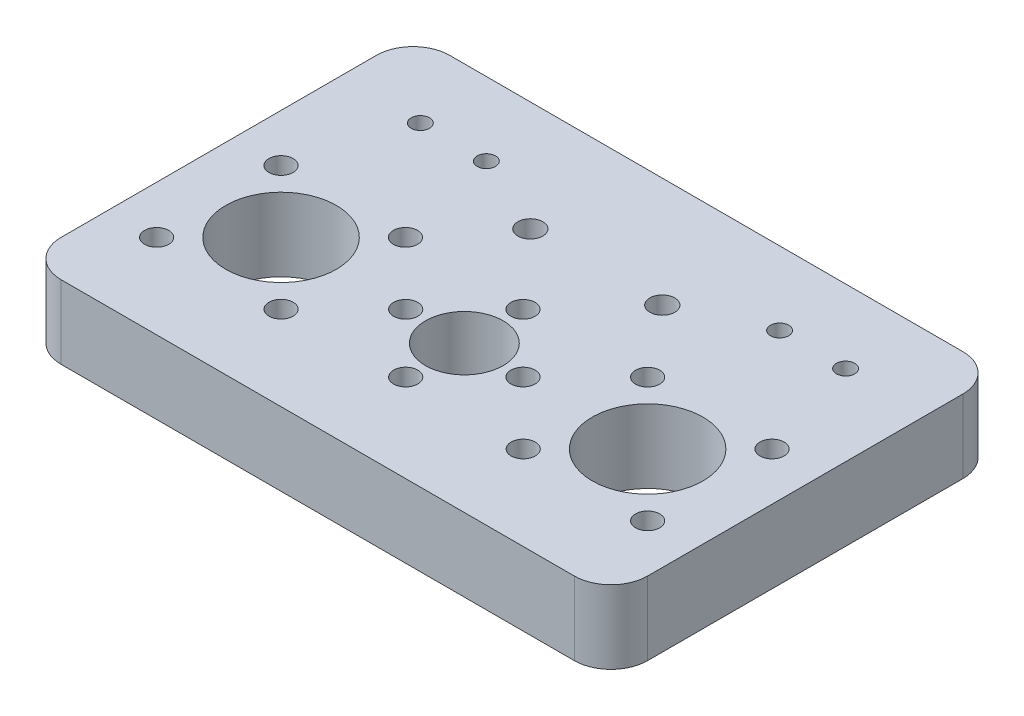
ISO-10303-21;
HEADER;
FILE_DESCRIPTION(('STEP AP214'),'2;1');
FILE_NAME('part.step','',(''),(''),'','','');
FILE_SCHEMA(('AUTOMOTIVE_DESIGN { 1 0 10303 214 1 1 1 1 }'));
ENDSEC;
DATA;
#1=APPLICATION_CONTEXT('core data for automotive mechanical design processes');
#2=APPLICATION_PROTOCOL_DEFINITION('international standard','automotive_design',2000,#1);
#3=PRODUCT_CONTEXT('',#1,'mechanical');
#4=PRODUCT('Part','Part','',(#3));
#5=PRODUCT_RELATED_PRODUCT_CATEGORY('part','',(#4));
#6=PRODUCT_DEFINITION_FORMATION('','',#4);
#7=PRODUCT_DEFINITION_CONTEXT('part definition',#1,'design');
#8=PRODUCT_DEFINITION('design','',#6,#7);
#9=PRODUCT_DEFINITION_SHAPE('','',#8);
#10=(LENGTH_UNIT() NAMED_UNIT(*) SI_UNIT(.MILLI.,.METRE.));
#11=(NAMED_UNIT(*) PLANE_ANGLE_UNIT() SI_UNIT($,.RADIAN.));
#12=(NAMED_UNIT(*) SI_UNIT($,.STERADIAN.) SOLID_ANGLE_UNIT());
#13=UNCERTAINTY_MEASURE_WITH_UNIT(LENGTH_MEASURE(1.E-05),#10,'distance_accuracy_value','');
#14=(GEOMETRIC_REPRESENTATION_CONTEXT(3) GLOBAL_UNCERTAINTY_ASSIGNED_CONTEXT((#13)) GLOBAL_UNIT_ASSIGNED_CONTEXT((#10,
#11,#12)) REPRESENTATION_CONTEXT('',''));
#15=CARTESIAN_POINT('',(0.,0.,0.));
#16=DIRECTION('',(0.,0.,1.));
#17=DIRECTION('',(1.,0.,0.));
#18=AXIS2_PLACEMENT_3D('',#15,#16,#17);
#19=CARTESIAN_POINT('',(0.,10.,-33.));
#20=DIRECTION('',(0.,0.,-1.));
#21=DIRECTION('',(-1.,0.,0.));
#22=AXIS2_PLACEMENT_3D('',#19,#20,#21);
#23=PLANE('',#22);
#24=DIRECTION('',(1.,0.,0.));
#25=VECTOR('',#24,1.);
#26=CARTESIAN_POINT('',(0.,0.,-33.));
#27=LINE('',#26,#25);
#28=CARTESIAN_POINT('',(-35.,0.,-33.));
#29=VERTEX_POINT('',#28);
#30=CARTESIAN_POINT('',(35.,0.,-33.));
#31=VERTEX_POINT('',#30);
#32=EDGE_CURVE('E189',#29,#31,#27,.T.);
#33=ORIENTED_EDGE('',*,*,#32,.F.);
#34=DIRECTION('',(0.,-1.,0.));
#35=VECTOR('',#34,1.);
#36=CARTESIAN_POINT('',(-35.,10.,-33.));
#37=LINE('',#36,#35);
#38=CARTESIAN_POINT('',(-35.,10.,-33.));
#39=VERTEX_POINT('',#38);
#40=EDGE_CURVE('E11',#39,#29,#37,.T.);
#41=ORIENTED_EDGE('',*,*,#40,.F.);
#42=DIRECTION('',(1.,0.,0.));
#43=VECTOR('',#42,1.);
#44=CARTESIAN_POINT('',(0.,10.,-33.));
#45=LINE('',#44,#43);
#46=CARTESIAN_POINT('',(35.,10.,-33.));
#47=VERTEX_POINT('',#46);
#48=EDGE_CURVE('E263',#39,#47,#45,.T.);
#49=ORIENTED_EDGE('',*,*,#48,.T.);
#50=DIRECTION('',(0.,-1.,0.));
#51=VECTOR('',#50,1.);
#52=CARTESIAN_POINT('',(35.,10.,-33.));
#53=LINE('',#52,#51);
#54=EDGE_CURVE('E87',#47,#31,#53,.T.);
#55=ORIENTED_EDGE('',*,*,#54,.T.);
#56=EDGE_LOOP('',(#33,#41,#49,#55));
#57=FACE_BOUND('',#56,.T.);
#58=ADVANCED_FACE('F37',(#57),#23,.T.);
#59=CARTESIAN_POINT('',(-35.,10.,-28.));
#60=DIRECTION('',(0.,-1.,0.));
#61=DIRECTION('',(0.,0.,-1.));
#62=AXIS2_PLACEMENT_3D('',#59,#60,#61);
#63=CYLINDRICAL_SURFACE('',#62,5.);
#64=CARTESIAN_POINT('',(-35.,0.,-28.));
#65=DIRECTION('',(0.,1.,0.));
#66=DIRECTION('',(0.,0.,1.));
#67=AXIS2_PLACEMENT_3D('',#64,#65,#66);
#68=CIRCLE('',#67,5.);
#69=CARTESIAN_POINT('',(-40.,0.,-28.));
#70=VERTEX_POINT('',#69);
#71=EDGE_CURVE('E192',#29,#70,#68,.T.);
#72=ORIENTED_EDGE('',*,*,#71,.T.);
#73=DIRECTION('',(0.,-1.,0.));
#74=VECTOR('',#73,1.);
#75=CARTESIAN_POINT('',(-40.,10.,-28.));
#76=LINE('',#75,#74);
#77=CARTESIAN_POINT('',(-40.,10.,-28.));
#78=VERTEX_POINT('',#77);
#79=EDGE_CURVE('E45',#78,#70,#76,.T.);
#80=ORIENTED_EDGE('',*,*,#79,.F.);
#81=CARTESIAN_POINT('',(-35.,10.,-28.));
#82=DIRECTION('',(0.,1.,0.));
#83=DIRECTION('',(0.,0.,1.));
#84=AXIS2_PLACEMENT_3D('',#81,#82,#83);
#85=CIRCLE('',#84,5.);
#86=EDGE_CURVE('E297',#39,#78,#85,.T.);
#87=ORIENTED_EDGE('',*,*,#86,.F.);
#88=ORIENTED_EDGE('',*,*,#40,.T.);
#89=EDGE_LOOP('',(#72,#80,#87,#88));
#90=FACE_BOUND('',#89,.T.);
#91=ADVANCED_FACE('F337',(#90),#63,.T.);
#92=CARTESIAN_POINT('',(-40.,10.,0.));
#93=DIRECTION('',(1.,0.,0.));
#94=DIRECTION('',(0.,0.,-1.));
#95=AXIS2_PLACEMENT_3D('',#92,#93,#94);
#96=PLANE('',#95);
#97=DIRECTION('',(0.,0.,1.));
#98=VECTOR('',#97,1.);
#99=CARTESIAN_POINT('',(-40.,0.,0.));
#100=LINE('',#99,#98);
#101=CARTESIAN_POINT('',(-40.,0.,15.));
#102=VERTEX_POINT('',#101);
#103=EDGE_CURVE('E195',#70,#102,#100,.T.);
#104=ORIENTED_EDGE('',*,*,#103,.T.);
#105=DIRECTION('',(0.,-1.,0.));
#106=VECTOR('',#105,1.);
#107=CARTESIAN_POINT('',(-40.,10.,15.));
#108=LINE('',#107,#106);
#109=CARTESIAN_POINT('',(-40.,10.,15.));
#110=VERTEX_POINT('',#109);
#111=EDGE_CURVE('E270',#110,#102,#108,.T.);
#112=ORIENTED_EDGE('',*,*,#111,.F.);
#113=DIRECTION('',(0.,0.,1.));
#114=VECTOR('',#113,1.);
#115=CARTESIAN_POINT('',(-40.,10.,0.));
#116=LINE('',#115,#114);
#117=EDGE_CURVE('E279',#78,#110,#116,.T.);
#118=ORIENTED_EDGE('',*,*,#117,.F.);
#119=ORIENTED_EDGE('',*,*,#79,.T.);
#120=EDGE_LOOP('',(#104,#112,#118,#119));
#121=FACE_BOUND('',#120,.T.);
#122=ADVANCED_FACE('F277',(#121),#96,.F.);
#123=CARTESIAN_POINT('',(-35.,10.,15.));
#124=DIRECTION('',(0.,-1.,0.));
#125=DIRECTION('',(0.,0.,-1.));
#126=AXIS2_PLACEMENT_3D('',#123,#124,#125);
#127=CYLINDRICAL_SURFACE('',#126,5.);
#128=CARTESIAN_POINT('',(-35.,0.,15.));
#129=DIRECTION('',(0.,1.,0.));
#130=DIRECTION('',(0.,0.,1.));
#131=AXIS2_PLACEMENT_3D('',#128,#129,#130);
#132=CIRCLE('',#131,5.);
#133=CARTESIAN_POINT('',(-35.,0.,20.));
#134=VERTEX_POINT('',#133);
#135=EDGE_CURVE('E197',#102,#134,#132,.T.);
#136=ORIENTED_EDGE('',*,*,#135,.T.);
#137=DIRECTION('',(0.,-1.,0.));
#138=VECTOR('',#137,1.);
#139=CARTESIAN_POINT('',(-35.,10.,20.));
#140=LINE('',#139,#138);
#141=CARTESIAN_POINT('',(-35.,10.,20.));
#142=VERTEX_POINT('',#141);
#143=EDGE_CURVE('E267',#142,#134,#140,.T.);
#144=ORIENTED_EDGE('',*,*,#143,.F.);
#145=CARTESIAN_POINT('',(-35.,10.,15.));
#146=DIRECTION('',(0.,1.,0.));
#147=DIRECTION('',(0.,0.,1.));
#148=AXIS2_PLACEMENT_3D('',#145,#146,#147);
#149=CIRCLE('',#148,5.);
#150=EDGE_CURVE('E293',#110,#142,#149,.T.);
#151=ORIENTED_EDGE('',*,*,#150,.F.);
#152=ORIENTED_EDGE('',*,*,#111,.T.);
#153=EDGE_LOOP('',(#136,#144,#151,#152));
#154=FACE_BOUND('',#153,.T.);
#155=ADVANCED_FACE('F289',(#154),#127,.T.);
#156=CARTESIAN_POINT('',(0.,10.,20.));
#157=DIRECTION('',(0.,0.,-1.));
#158=DIRECTION('',(-1.,0.,0.));
#159=AXIS2_PLACEMENT_3D('',#156,#157,#158);
#160=PLANE('',#159);
#161=DIRECTION('',(1.,0.,0.));
#162=VECTOR('',#161,1.);
#163=CARTESIAN_POINT('',(0.,0.,20.));
#164=LINE('',#163,#162);
#165=CARTESIAN_POINT('',(35.,0.,20.));
#166=VERTEX_POINT('',#165);
#167=EDGE_CURVE('E199',#134,#166,#164,.T.);
#168=ORIENTED_EDGE('',*,*,#167,.T.);
#169=DIRECTION('',(0.,-1.,0.));
#170=VECTOR('',#169,1.);
#171=CARTESIAN_POINT('',(35.,10.,20.));
#172=LINE('',#171,#170);
#173=CARTESIAN_POINT('',(35.,10.,20.));
#174=VERTEX_POINT('',#173);
#175=EDGE_CURVE('E125',#174,#166,#172,.T.);
#176=ORIENTED_EDGE('',*,*,#175,.F.);
#177=DIRECTION('',(1.,0.,0.));
#178=VECTOR('',#177,1.);
#179=CARTESIAN_POINT('',(0.,10.,20.));
#180=LINE('',#179,#178);
#181=EDGE_CURVE('E112',#142,#174,#180,.T.);
#182=ORIENTED_EDGE('',*,*,#181,.F.);
#183=ORIENTED_EDGE('',*,*,#143,.T.);
#184=EDGE_LOOP('',(#168,#176,#182,#183));
#185=FACE_BOUND('',#184,.T.);
#186=ADVANCED_FACE('F292',(#185),#160,.F.);
#187=CARTESIAN_POINT('',(35.,10.,15.));
#188=DIRECTION('',(0.,-1.,0.));
#189=DIRECTION('',(0.,0.,-1.));
#190=AXIS2_PLACEMENT_3D('',#187,#188,#189);
#191=CYLINDRICAL_SURFACE('',#190,5.);
#192=CARTESIAN_POINT('',(35.,0.,15.));
#193=DIRECTION('',(0.,1.,0.));
#194=DIRECTION('',(0.,0.,1.));
#195=AXIS2_PLACEMENT_3D('',#192,#193,#194);
#196=CIRCLE('',#195,5.);
#197=CARTESIAN_POINT('',(40.,0.,15.));
#198=VERTEX_POINT('',#197);
#199=EDGE_CURVE('E121',#166,#198,#196,.T.);
#200=ORIENTED_EDGE('',*,*,#199,.T.);
#201=DIRECTION('',(0.,-1.,0.));
#202=VECTOR('',#201,1.);
#203=CARTESIAN_POINT('',(40.,10.,15.));
#204=LINE('',#203,#202);
#205=CARTESIAN_POINT('',(40.,10.,15.));
#206=VERTEX_POINT('',#205);
#207=EDGE_CURVE('E118',#206,#198,#204,.T.);
#208=ORIENTED_EDGE('',*,*,#207,.F.);
#209=CARTESIAN_POINT('',(35.,10.,15.));
#210=DIRECTION('',(0.,1.,0.));
#211=DIRECTION('',(0.,0.,1.));
#212=AXIS2_PLACEMENT_3D('',#209,#210,#211);
#213=CIRCLE('',#212,5.);
#214=EDGE_CURVE('E105',#174,#206,#213,.T.);
#215=ORIENTED_EDGE('',*,*,#214,.F.);
#216=ORIENTED_EDGE('',*,*,#175,.T.);
#217=EDGE_LOOP('',(#200,#208,#215,#216));
#218=FACE_BOUND('',#217,.T.);
#219=ADVANCED_FACE('F119',(#218),#191,.T.);
#220=CARTESIAN_POINT('',(40.,10.,0.));
#221=DIRECTION('',(1.,0.,0.));
#222=DIRECTION('',(0.,0.,-1.));
#223=AXIS2_PLACEMENT_3D('',#220,#221,#222);
#224=PLANE('',#223);
#225=DIRECTION('',(0.,0.,1.));
#226=VECTOR('',#225,1.);
#227=CARTESIAN_POINT('',(40.,0.,0.));
#228=LINE('',#227,#226);
#229=CARTESIAN_POINT('',(40.,0.,-28.));
#230=VERTEX_POINT('',#229);
#231=EDGE_CURVE('E202',#230,#198,#228,.T.);
#232=ORIENTED_EDGE('',*,*,#231,.F.);
#233=DIRECTION('',(0.,-1.,0.));
#234=VECTOR('',#233,1.);
#235=CARTESIAN_POINT('',(40.,10.,-28.));
#236=LINE('',#235,#234);
#237=CARTESIAN_POINT('',(40.,10.,-28.));
#238=VERTEX_POINT('',#237);
#239=EDGE_CURVE('E80',#238,#230,#236,.T.);
#240=ORIENTED_EDGE('',*,*,#239,.F.);
#241=DIRECTION('',(0.,0.,1.));
#242=VECTOR('',#241,1.);
#243=CARTESIAN_POINT('',(40.,10.,0.));
#244=LINE('',#243,#242);
#245=EDGE_CURVE('E110',#238,#206,#244,.T.);
#246=ORIENTED_EDGE('',*,*,#245,.T.);
#247=ORIENTED_EDGE('',*,*,#207,.T.);
#248=EDGE_LOOP('',(#232,#240,#246,#247));
#249=FACE_BOUND('',#248,.T.);
#250=ADVANCED_FACE('F127',(#249),#224,.T.);
#251=CARTESIAN_POINT('',(-29.,10.,-23.));
#252=DIRECTION('',(0.,-1.,0.));
#253=DIRECTION('',(0.,0.,-1.));
#254=AXIS2_PLACEMENT_3D('',#251,#252,#253);
#255=CYLINDRICAL_SURFACE('',#254,1.25);
#256=CARTESIAN_POINT('',(-29.,10.,-23.));
#257=DIRECTION('',(0.,1.,0.));
#258=DIRECTION('',(0.,0.,1.));
#259=AXIS2_PLACEMENT_3D('',#256,#257,#258);
#260=CIRCLE('',#259,1.25);
#261=CARTESIAN_POINT('',(-29.,10.,-21.75));
#262=VERTEX_POINT('',#261);
#263=EDGE_CURVE('E183',#262,#262,#260,.T.);
#264=ORIENTED_EDGE('',*,*,#263,.T.);
#265=EDGE_LOOP('',(#264));
#266=FACE_BOUND('',#265,.T.);
#267=CARTESIAN_POINT('',(-29.,0.,-23.));
#268=DIRECTION('',(0.,1.,0.));
#269=DIRECTION('',(0.,0.,1.));
#270=AXIS2_PLACEMENT_3D('',#267,#268,#269);
#271=CIRCLE('',#270,1.25);
#272=CARTESIAN_POINT('',(-29.,0.,-21.75));
#273=VERTEX_POINT('',#272);
#274=EDGE_CURVE('E257',#273,#273,#271,.T.);
#275=ORIENTED_EDGE('',*,*,#274,.F.);
#276=EDGE_LOOP('',(#275));
#277=FACE_BOUND('',#276,.T.);
#278=ADVANCED_FACE('F358',(#266,#277),#255,.F.);
#279=CARTESIAN_POINT('',(33.4852813742386,10.,-8.48528137423854));
#280=DIRECTION('',(0.,-1.,0.));
#281=DIRECTION('',(0.,0.,-1.));
#282=AXIS2_PLACEMENT_3D('',#279,#280,#281);
#283=CYLINDRICAL_SURFACE('',#282,1.65);
#284=CARTESIAN_POINT('',(33.4852813742386,10.,-8.48528137423854));
#285=DIRECTION('',(0.,1.,0.));
#286=DIRECTION('',(0.,0.,1.));
#287=AXIS2_PLACEMENT_3D('',#284,#285,#286);
#288=CIRCLE('',#287,1.65);
#289=CARTESIAN_POINT('',(33.4852813742386,10.,-6.83528137423855));
#290=VERTEX_POINT('',#289);
#291=EDGE_CURVE('E180',#290,#290,#288,.F.);
#292=ORIENTED_EDGE('',*,*,#291,.F.);
#293=EDGE_LOOP('',(#292));
#294=FACE_BOUND('',#293,.T.);
#295=CARTESIAN_POINT('',(33.4852813742386,0.,-8.48528137423854));
#296=DIRECTION('',(0.,1.,0.));
#297=DIRECTION('',(0.,0.,1.));
#298=AXIS2_PLACEMENT_3D('',#295,#296,#297);
#299=CIRCLE('',#298,1.65);
#300=CARTESIAN_POINT('',(33.4852813742386,0.,-6.83528137423855));
#301=VERTEX_POINT('',#300);
#302=EDGE_CURVE('E254',#301,#301,#299,.F.);
#303=ORIENTED_EDGE('',*,*,#302,.T.);
#304=EDGE_LOOP('',(#303));
#305=FACE_BOUND('',#304,.T.);
#306=ADVANCED_FACE('F392',(#294,#305),#283,.F.);
#307=CARTESIAN_POINT('',(16.5147186257614,10.,8.48528137423852));
#308=DIRECTION('',(0.,-1.,0.));
#309=DIRECTION('',(0.,0.,-1.));
#310=AXIS2_PLACEMENT_3D('',#307,#308,#309);
#311=CYLINDRICAL_SURFACE('',#310,1.64999999999999);
#312=CARTESIAN_POINT('',(16.5147186257614,10.,8.48528137423852));
#313=DIRECTION('',(0.,1.,0.));
#314=DIRECTION('',(0.,0.,1.));
#315=AXIS2_PLACEMENT_3D('',#312,#313,#314);
#316=CIRCLE('',#315,1.64999999999999);
#317=CARTESIAN_POINT('',(16.5147186257614,10.,10.1352813742385));
#318=VERTEX_POINT('',#317);
#319=EDGE_CURVE('E177',#318,#318,#316,.F.);
#320=ORIENTED_EDGE('',*,*,#319,.F.);
#321=EDGE_LOOP('',(#320));
#322=FACE_BOUND('',#321,.T.);
#323=CARTESIAN_POINT('',(16.5147186257614,0.,8.48528137423852));
#324=DIRECTION('',(0.,1.,0.));
#325=DIRECTION('',(0.,0.,1.));
#326=AXIS2_PLACEMENT_3D('',#323,#324,#325);
#327=CIRCLE('',#326,1.64999999999999);
#328=CARTESIAN_POINT('',(16.5147186257614,0.,10.1352813742385));
#329=VERTEX_POINT('',#328);
#330=EDGE_CURVE('E251',#329,#329,#327,.F.);
#331=ORIENTED_EDGE('',*,*,#330,.T.);
#332=EDGE_LOOP('',(#331));
#333=FACE_BOUND('',#332,.T.);
#334=ADVANCED_FACE('F400',(#322,#333),#311,.F.);
#335=CARTESIAN_POINT('',(25.,10.,0.));
#336=DIRECTION('',(0.,-1.,0.));
#337=DIRECTION('',(0.,0.,-1.));
#338=AXIS2_PLACEMENT_3D('',#335,#336,#337);
#339=CYLINDRICAL_SURFACE('',#338,7.55);
#340=CARTESIAN_POINT('',(25.,10.,0.));
#341=DIRECTION('',(0.,1.,0.));
#342=DIRECTION('',(0.,0.,1.));
#343=AXIS2_PLACEMENT_3D('',#340,#341,#342);
#344=CIRCLE('',#343,7.55);
#345=CARTESIAN_POINT('',(25.,10.,7.55));
#346=VERTEX_POINT('',#345);
#347=EDGE_CURVE('E174',#346,#346,#344,.F.);
#348=ORIENTED_EDGE('',*,*,#347,.F.);
#349=EDGE_LOOP('',(#348));
#350=FACE_BOUND('',#349,.T.);
#351=CARTESIAN_POINT('',(25.,0.,0.));
#352=DIRECTION('',(0.,1.,0.));
#353=DIRECTION('',(0.,0.,1.));
#354=AXIS2_PLACEMENT_3D('',#351,#352,#353);
#355=CIRCLE('',#354,7.55);
#356=CARTESIAN_POINT('',(25.,0.,7.55));
#357=VERTEX_POINT('',#356);
#358=EDGE_CURVE('E248',#357,#357,#355,.F.);
#359=ORIENTED_EDGE('',*,*,#358,.T.);
#360=EDGE_LOOP('',(#359));
#361=FACE_BOUND('',#360,.T.);
#362=ADVANCED_FACE('F408',(#350,#361),#339,.F.);
#363=CARTESIAN_POINT('',(-33.4852813742385,10.,8.48528137423861));
#364=DIRECTION('',(0.,-1.,0.));
#365=DIRECTION('',(0.,0.,-1.));
#366=AXIS2_PLACEMENT_3D('',#363,#364,#365);
#367=CYLINDRICAL_SURFACE('',#366,1.65);
#368=CARTESIAN_POINT('',(-33.4852813742385,10.,8.48528137423861));
#369=DIRECTION('',(0.,1.,0.));
#370=DIRECTION('',(0.,0.,1.));
#371=AXIS2_PLACEMENT_3D('',#368,#369,#370);
#372=CIRCLE('',#371,1.65);
#373=CARTESIAN_POINT('',(-33.4852813742385,10.,10.1352813742386));
#374=VERTEX_POINT('',#373);
#375=EDGE_CURVE('E171',#374,#374,#372,.T.);
#376=ORIENTED_EDGE('',*,*,#375,.T.);
#377=EDGE_LOOP('',(#376));
#378=FACE_BOUND('',#377,.T.);
#379=CARTESIAN_POINT('',(-33.4852813742385,0.,8.48528137423861));
#380=DIRECTION('',(0.,1.,0.));
#381=DIRECTION('',(0.,0.,1.));
#382=AXIS2_PLACEMENT_3D('',#379,#380,#381);
#383=CIRCLE('',#382,1.65);
#384=CARTESIAN_POINT('',(-33.4852813742385,0.,10.1352813742386));
#385=VERTEX_POINT('',#384);
#386=EDGE_CURVE('E245',#385,#385,#383,.T.);
#387=ORIENTED_EDGE('',*,*,#386,.F.);
#388=EDGE_LOOP('',(#387));
#389=FACE_BOUND('',#388,.T.);
#390=ADVANCED_FACE('F416',(#378,#389),#367,.F.);
#391=CARTESIAN_POINT('',(-16.5147186257614,10.,8.48528137423852));
#392=DIRECTION('',(0.,-1.,0.));
#393=DIRECTION('',(0.,0.,-1.));
#394=AXIS2_PLACEMENT_3D('',#391,#392,#393);
#395=CYLINDRICAL_SURFACE('',#394,1.64999999999999);
#396=CARTESIAN_POINT('',(-16.5147186257614,10.,8.48528137423852));
#397=DIRECTION('',(0.,1.,0.));
#398=DIRECTION('',(0.,0.,1.));
#399=AXIS2_PLACEMENT_3D('',#396,#397,#398);
#400=CIRCLE('',#399,1.64999999999999);
#401=CARTESIAN_POINT('',(-16.5147186257614,10.,10.1352813742385));
#402=VERTEX_POINT('',#401);
#403=EDGE_CURVE('E168',#402,#402,#400,.T.);
#404=ORIENTED_EDGE('',*,*,#403,.T.);
#405=EDGE_LOOP('',(#404));
#406=FACE_BOUND('',#405,.T.);
#407=CARTESIAN_POINT('',(-16.5147186257614,0.,8.48528137423852));
#408=DIRECTION('',(0.,1.,0.));
#409=DIRECTION('',(0.,0.,1.));
#410=AXIS2_PLACEMENT_3D('',#407,#408,#409);
#411=CIRCLE('',#410,1.64999999999999);
#412=CARTESIAN_POINT('',(-16.5147186257614,0.,10.1352813742385));
#413=VERTEX_POINT('',#412);
#414=EDGE_CURVE('E242',#413,#413,#411,.T.);
#415=ORIENTED_EDGE('',*,*,#414,.F.);
#416=EDGE_LOOP('',(#415));
#417=FACE_BOUND('',#416,.T.);
#418=ADVANCED_FACE('F424',(#406,#417),#395,.F.);
#419=CARTESIAN_POINT('',(-16.5147186257615,10.,-8.48528137423862));
#420=DIRECTION('',(0.,-1.,0.));
#421=DIRECTION('',(0.,0.,-1.));
#422=AXIS2_PLACEMENT_3D('',#419,#420,#421);
#423=CYLINDRICAL_SURFACE('',#422,1.65);
#424=CARTESIAN_POINT('',(-16.5147186257615,10.,-8.48528137423862));
#425=DIRECTION('',(0.,1.,0.));
#426=DIRECTION('',(0.,0.,1.));
#427=AXIS2_PLACEMENT_3D('',#424,#425,#426);
#428=CIRCLE('',#427,1.65);
#429=CARTESIAN_POINT('',(-16.5147186257615,10.,-6.83528137423862));
#430=VERTEX_POINT('',#429);
#431=EDGE_CURVE('E165',#430,#430,#428,.T.);
#432=ORIENTED_EDGE('',*,*,#431,.T.);
#433=EDGE_LOOP('',(#432));
#434=FACE_BOUND('',#433,.T.);
#435=CARTESIAN_POINT('',(-16.5147186257615,0.,-8.48528137423862));
#436=DIRECTION('',(0.,1.,0.));
#437=DIRECTION('',(0.,0.,1.));
#438=AXIS2_PLACEMENT_3D('',#435,#436,#437);
#439=CIRCLE('',#438,1.65);
#440=CARTESIAN_POINT('',(-16.5147186257615,0.,-6.83528137423862));
#441=VERTEX_POINT('',#440);
#442=EDGE_CURVE('E239',#441,#441,#439,.T.);
#443=ORIENTED_EDGE('',*,*,#442,.F.);
#444=EDGE_LOOP('',(#443));
#445=FACE_BOUND('',#444,.T.);
#446=ADVANCED_FACE('F432',(#434,#445),#423,.F.);
#447=CARTESIAN_POINT('',(-33.4852813742386,10.,-8.48528137423853));
#448=DIRECTION('',(0.,-1.,0.));
#449=DIRECTION('',(0.,0.,-1.));
#450=AXIS2_PLACEMENT_3D('',#447,#448,#449);
#451=CYLINDRICAL_SURFACE('',#450,1.65);
#452=CARTESIAN_POINT('',(-33.4852813742386,10.,-8.48528137423853));
#453=DIRECTION('',(0.,1.,0.));
#454=DIRECTION('',(0.,0.,1.));
#455=AXIS2_PLACEMENT_3D('',#452,#453,#454);
#456=CIRCLE('',#455,1.65);
#457=CARTESIAN_POINT('',(-33.4852813742386,10.,-6.83528137423853));
#458=VERTEX_POINT('',#457);
#459=EDGE_CURVE('E162',#458,#458,#456,.T.);
#460=ORIENTED_EDGE('',*,*,#459,.T.);
#461=EDGE_LOOP('',(#460));
#462=FACE_BOUND('',#461,.T.);
#463=CARTESIAN_POINT('',(-33.4852813742386,0.,-8.48528137423853));
#464=DIRECTION('',(0.,1.,0.));
#465=DIRECTION('',(0.,0.,1.));
#466=AXIS2_PLACEMENT_3D('',#463,#464,#465);
#467=CIRCLE('',#466,1.65);
#468=CARTESIAN_POINT('',(-33.4852813742386,0.,-6.83528137423853));
#469=VERTEX_POINT('',#468);
#470=EDGE_CURVE('E236',#469,#469,#467,.T.);
#471=ORIENTED_EDGE('',*,*,#470,.F.);
#472=EDGE_LOOP('',(#471));
#473=FACE_BOUND('',#472,.T.);
#474=ADVANCED_FACE('F440',(#462,#473),#451,.F.);
#475=CARTESIAN_POINT('',(-25.,10.,0.));
#476=DIRECTION('',(0.,-1.,0.));
#477=DIRECTION('',(0.,0.,-1.));
#478=AXIS2_PLACEMENT_3D('',#475,#476,#477);
#479=CYLINDRICAL_SURFACE('',#478,7.55);
#480=CARTESIAN_POINT('',(-25.,10.,0.));
#481=DIRECTION('',(0.,1.,0.));
#482=DIRECTION('',(0.,0.,1.));
#483=AXIS2_PLACEMENT_3D('',#480,#481,#482);
#484=CIRCLE('',#483,7.55);
#485=CARTESIAN_POINT('',(-25.,10.,7.55));
#486=VERTEX_POINT('',#485);
#487=EDGE_CURVE('E159',#486,#486,#484,.T.);
#488=ORIENTED_EDGE('',*,*,#487,.T.);
#489=EDGE_LOOP('',(#488));
#490=FACE_BOUND('',#489,.T.);
#491=CARTESIAN_POINT('',(-25.,0.,0.));
#492=DIRECTION('',(0.,1.,0.));
#493=DIRECTION('',(0.,0.,1.));
#494=AXIS2_PLACEMENT_3D('',#491,#492,#493);
#495=CIRCLE('',#494,7.55);
#496=CARTESIAN_POINT('',(-25.,0.,7.55));
#497=VERTEX_POINT('',#496);
#498=EDGE_CURVE('E233',#497,#497,#495,.T.);
#499=ORIENTED_EDGE('',*,*,#498,.F.);
#500=EDGE_LOOP('',(#499));
#501=FACE_BOUND('',#500,.T.);
#502=ADVANCED_FACE('F448',(#490,#501),#479,.F.);
#503=CARTESIAN_POINT('',(-8.,10.,0.));
#504=DIRECTION('',(0.,-1.,0.));
#505=DIRECTION('',(0.,0.,-1.));
#506=AXIS2_PLACEMENT_3D('',#503,#504,#505);
#507=CYLINDRICAL_SURFACE('',#506,1.64999999999997);
#508=CARTESIAN_POINT('',(-8.,10.,0.));
#509=DIRECTION('',(0.,1.,0.));
#510=DIRECTION('',(0.,0.,1.));
#511=AXIS2_PLACEMENT_3D('',#508,#509,#510);
#512=CIRCLE('',#511,1.64999999999997);
#513=CARTESIAN_POINT('',(-8.,10.,1.64999999999996));
#514=VERTEX_POINT('',#513);
#515=EDGE_CURVE('E156',#514,#514,#512,.T.);
#516=ORIENTED_EDGE('',*,*,#515,.T.);
#517=EDGE_LOOP('',(#516));
#518=FACE_BOUND('',#517,.T.);
#519=CARTESIAN_POINT('',(-8.,0.,0.));
#520=DIRECTION('',(0.,1.,0.));
#521=DIRECTION('',(0.,0.,1.));
#522=AXIS2_PLACEMENT_3D('',#519,#520,#521);
#523=CIRCLE('',#522,1.64999999999997);
#524=CARTESIAN_POINT('',(-8.,0.,1.64999999999996));
#525=VERTEX_POINT('',#524);
#526=EDGE_CURVE('E230',#525,#525,#523,.T.);
#527=ORIENTED_EDGE('',*,*,#526,.F.);
#528=EDGE_LOOP('',(#527));
#529=FACE_BOUND('',#528,.T.);
#530=ADVANCED_FACE('F456',(#518,#529),#507,.F.);
#531=CARTESIAN_POINT('',(0.,10.,8.));
#532=DIRECTION('',(0.,-1.,0.));
#533=DIRECTION('',(0.,0.,-1.));
#534=AXIS2_PLACEMENT_3D('',#531,#532,#533);
#535=CYLINDRICAL_SURFACE('',#534,1.65);
#536=CARTESIAN_POINT('',(0.,10.,8.));
#537=DIRECTION('',(0.,1.,0.));
#538=DIRECTION('',(0.,0.,1.));
#539=AXIS2_PLACEMENT_3D('',#536,#537,#538);
#540=CIRCLE('',#539,1.65);
#541=CARTESIAN_POINT('',(0.,10.,9.65));
#542=VERTEX_POINT('',#541);
#543=EDGE_CURVE('E153',#542,#542,#540,.T.);
#544=ORIENTED_EDGE('',*,*,#543,.T.);
#545=EDGE_LOOP('',(#544));
#546=FACE_BOUND('',#545,.T.);
#547=CARTESIAN_POINT('',(0.,0.,8.));
#548=DIRECTION('',(0.,1.,0.));
#549=DIRECTION('',(0.,0.,1.));
#550=AXIS2_PLACEMENT_3D('',#547,#548,#549);
#551=CIRCLE('',#550,1.65);
#552=CARTESIAN_POINT('',(0.,0.,9.65));
#553=VERTEX_POINT('',#552);
#554=EDGE_CURVE('E227',#553,#553,#551,.T.);
#555=ORIENTED_EDGE('',*,*,#554,.F.);
#556=EDGE_LOOP('',(#555));
#557=FACE_BOUND('',#556,.T.);
#558=ADVANCED_FACE('F464',(#546,#557),#535,.F.);
#559=CARTESIAN_POINT('',(8.,10.,0.));
#560=DIRECTION('',(0.,-1.,0.));
#561=DIRECTION('',(0.,0.,-1.));
#562=AXIS2_PLACEMENT_3D('',#559,#560,#561);
#563=CYLINDRICAL_SURFACE('',#562,1.65);
#564=CARTESIAN_POINT('',(8.,10.,0.));
#565=DIRECTION('',(0.,1.,0.));
#566=DIRECTION('',(0.,0.,1.));
#567=AXIS2_PLACEMENT_3D('',#564,#565,#566);
#568=CIRCLE('',#567,1.65);
#569=CARTESIAN_POINT('',(8.,10.,1.65000000000003));
#570=VERTEX_POINT('',#569);
#571=EDGE_CURVE('E150',#570,#570,#568,.T.);
#572=ORIENTED_EDGE('',*,*,#571,.T.);
#573=EDGE_LOOP('',(#572));
#574=FACE_BOUND('',#573,.T.);
#575=CARTESIAN_POINT('',(8.,0.,0.));
#576=DIRECTION('',(0.,1.,0.));
#577=DIRECTION('',(0.,0.,1.));
#578=AXIS2_PLACEMENT_3D('',#575,#576,#577);
#579=CIRCLE('',#578,1.65);
#580=CARTESIAN_POINT('',(8.,0.,1.65000000000003));
#581=VERTEX_POINT('',#580);
#582=EDGE_CURVE('E224',#581,#581,#579,.T.);
#583=ORIENTED_EDGE('',*,*,#582,.F.);
#584=EDGE_LOOP('',(#583));
#585=FACE_BOUND('',#584,.T.);
#586=ADVANCED_FACE('F472',(#574,#585),#563,.F.);
#587=CARTESIAN_POINT('',(0.,10.,-8.));
#588=DIRECTION('',(0.,-1.,0.));
#589=DIRECTION('',(0.,0.,-1.));
#590=AXIS2_PLACEMENT_3D('',#587,#588,#589);
#591=CYLINDRICAL_SURFACE('',#590,1.65);
#592=CARTESIAN_POINT('',(0.,10.,-8.));
#593=DIRECTION('',(0.,1.,0.));
#594=DIRECTION('',(0.,0.,1.));
#595=AXIS2_PLACEMENT_3D('',#592,#593,#594);
#596=CIRCLE('',#595,1.65);
#597=CARTESIAN_POINT('',(0.,10.,-6.35));
#598=VERTEX_POINT('',#597);
#599=EDGE_CURVE('E147',#598,#598,#596,.T.);
#600=ORIENTED_EDGE('',*,*,#599,.T.);
#601=EDGE_LOOP('',(#600));
#602=FACE_BOUND('',#601,.T.);
#603=CARTESIAN_POINT('',(0.,0.,-8.));
#604=DIRECTION('',(0.,1.,0.));
#605=DIRECTION('',(0.,0.,1.));
#606=AXIS2_PLACEMENT_3D('',#603,#604,#605);
#607=CIRCLE('',#606,1.65);
#608=CARTESIAN_POINT('',(0.,0.,-6.35));
#609=VERTEX_POINT('',#608);
#610=EDGE_CURVE('E221',#609,#609,#607,.T.);
#611=ORIENTED_EDGE('',*,*,#610,.F.);
#612=EDGE_LOOP('',(#611));
#613=FACE_BOUND('',#612,.T.);
#614=ADVANCED_FACE('F480',(#602,#613),#591,.F.);
#615=CARTESIAN_POINT('',(0.,10.,0.));
#616=DIRECTION('',(0.,-1.,0.));
#617=DIRECTION('',(0.,0.,-1.));
#618=AXIS2_PLACEMENT_3D('',#615,#616,#617);
#619=CYLINDRICAL_SURFACE('',#618,5.3);
#620=CARTESIAN_POINT('',(0.,10.,0.));
#621=DIRECTION('',(0.,1.,0.));
#622=DIRECTION('',(0.,0.,1.));
#623=AXIS2_PLACEMENT_3D('',#620,#621,#622);
#624=CIRCLE('',#623,5.3);
#625=CARTESIAN_POINT('',(0.,10.,5.3));
#626=VERTEX_POINT('',#625);
#627=EDGE_CURVE('E144',#626,#626,#624,.T.);
#628=ORIENTED_EDGE('',*,*,#627,.T.);
#629=EDGE_LOOP('',(#628));
#630=FACE_BOUND('',#629,.T.);
#631=CARTESIAN_POINT('',(0.,0.,0.));
#632=DIRECTION('',(0.,1.,0.));
#633=DIRECTION('',(0.,0.,1.));
#634=AXIS2_PLACEMENT_3D('',#631,#632,#633);
#635=CIRCLE('',#634,5.3);
#636=CARTESIAN_POINT('',(0.,0.,5.3));
#637=VERTEX_POINT('',#636);
#638=EDGE_CURVE('E218',#637,#637,#635,.T.);
#639=ORIENTED_EDGE('',*,*,#638,.F.);
#640=EDGE_LOOP('',(#639));
#641=FACE_BOUND('',#640,.T.);
#642=ADVANCED_FACE('F488',(#630,#641),#619,.F.);
#643=CARTESIAN_POINT('',(16.5147186257615,10.,-8.48528137423862));
#644=DIRECTION('',(0.,-1.,0.));
#645=DIRECTION('',(0.,0.,-1.));
#646=AXIS2_PLACEMENT_3D('',#643,#644,#645);
#647=CYLINDRICAL_SURFACE('',#646,1.65);
#648=CARTESIAN_POINT('',(16.5147186257615,10.,-8.48528137423862));
#649=DIRECTION('',(0.,1.,0.));
#650=DIRECTION('',(0.,0.,1.));
#651=AXIS2_PLACEMENT_3D('',#648,#649,#650);
#652=CIRCLE('',#651,1.65);
#653=CARTESIAN_POINT('',(16.5147186257615,10.,-6.83528137423862));
#654=VERTEX_POINT('',#653);
#655=EDGE_CURVE('E141',#654,#654,#652,.F.);
#656=ORIENTED_EDGE('',*,*,#655,.F.);
#657=EDGE_LOOP('',(#656));
#658=FACE_BOUND('',#657,.T.);
#659=CARTESIAN_POINT('',(16.5147186257615,0.,-8.48528137423862));
#660=DIRECTION('',(0.,1.,0.));
#661=DIRECTION('',(0.,0.,1.));
#662=AXIS2_PLACEMENT_3D('',#659,#660,#661);
#663=CIRCLE('',#662,1.65);
#664=CARTESIAN_POINT('',(16.5147186257615,0.,-6.83528137423862));
#665=VERTEX_POINT('',#664);
#666=EDGE_CURVE('E215',#665,#665,#663,.F.);
#667=ORIENTED_EDGE('',*,*,#666,.T.);
#668=EDGE_LOOP('',(#667));
#669=FACE_BOUND('',#668,.T.);
#670=ADVANCED_FACE('F496',(#658,#669),#647,.F.);
#671=CARTESIAN_POINT('',(33.4852813742385,10.,8.48528137423861));
#672=DIRECTION('',(0.,-1.,0.));
#673=DIRECTION('',(0.,0.,-1.));
#674=AXIS2_PLACEMENT_3D('',#671,#672,#673);
#675=CYLINDRICAL_SURFACE('',#674,1.65);
#676=CARTESIAN_POINT('',(33.4852813742385,10.,8.48528137423861));
#677=DIRECTION('',(0.,1.,0.));
#678=DIRECTION('',(0.,0.,1.));
#679=AXIS2_PLACEMENT_3D('',#676,#677,#678);
#680=CIRCLE('',#679,1.65);
#681=CARTESIAN_POINT('',(33.4852813742385,10.,10.1352813742386));
#682=VERTEX_POINT('',#681);
#683=EDGE_CURVE('E138',#682,#682,#680,.F.);
#684=ORIENTED_EDGE('',*,*,#683,.F.);
#685=EDGE_LOOP('',(#684));
#686=FACE_BOUND('',#685,.T.);
#687=CARTESIAN_POINT('',(33.4852813742385,0.,8.48528137423861));
#688=DIRECTION('',(0.,1.,0.));
#689=DIRECTION('',(0.,0.,1.));
#690=AXIS2_PLACEMENT_3D('',#687,#688,#689);
#691=CIRCLE('',#690,1.65);
#692=CARTESIAN_POINT('',(33.4852813742385,0.,10.1352813742386));
#693=VERTEX_POINT('',#692);
#694=EDGE_CURVE('E212',#693,#693,#691,.F.);
#695=ORIENTED_EDGE('',*,*,#694,.T.);
#696=EDGE_LOOP('',(#695));
#697=FACE_BOUND('',#696,.T.);
#698=ADVANCED_FACE('F504',(#686,#697),#675,.F.);
#699=CARTESIAN_POINT('',(-20.,10.,-23.));
#700=DIRECTION('',(0.,-1.,0.));
#701=DIRECTION('',(0.,0.,-1.));
#702=AXIS2_PLACEMENT_3D('',#699,#700,#701);
#703=CYLINDRICAL_SURFACE('',#702,1.25);
#704=CARTESIAN_POINT('',(-20.,10.,-23.));
#705=DIRECTION('',(0.,1.,0.));
#706=DIRECTION('',(0.,0.,1.));
#707=AXIS2_PLACEMENT_3D('',#704,#705,#706);
#708=CIRCLE('',#707,1.25);
#709=CARTESIAN_POINT('',(-20.,10.,-21.75));
#710=VERTEX_POINT('',#709);
#711=EDGE_CURVE('E135',#710,#710,#708,.T.);
#712=ORIENTED_EDGE('',*,*,#711,.T.);
#713=EDGE_LOOP('',(#712));
#714=FACE_BOUND('',#713,.T.);
#715=CARTESIAN_POINT('',(-20.,0.,-23.));
#716=DIRECTION('',(0.,1.,0.));
#717=DIRECTION('',(0.,0.,1.));
#718=AXIS2_PLACEMENT_3D('',#715,#716,#717);
#719=CIRCLE('',#718,1.25);
#720=CARTESIAN_POINT('',(-20.,0.,-21.75));
#721=VERTEX_POINT('',#720);
#722=EDGE_CURVE('E209',#721,#721,#719,.T.);
#723=ORIENTED_EDGE('',*,*,#722,.F.);
#724=EDGE_LOOP('',(#723));
#725=FACE_BOUND('',#724,.T.);
#726=ADVANCED_FACE('F351',(#714,#725),#703,.F.);
#727=CARTESIAN_POINT('',(20.,10.,-23.));
#728=DIRECTION('',(0.,-1.,0.));
#729=DIRECTION('',(0.,0.,-1.));
#730=AXIS2_PLACEMENT_3D('',#727,#728,#729);
#731=CYLINDRICAL_SURFACE('',#730,1.25);
#732=CARTESIAN_POINT('',(20.,10.,-23.));
#733=DIRECTION('',(0.,1.,0.));
#734=DIRECTION('',(0.,0.,1.));
#735=AXIS2_PLACEMENT_3D('',#732,#733,#734);
#736=CIRCLE('',#735,1.25);
#737=CARTESIAN_POINT('',(20.,10.,-21.75));
#738=VERTEX_POINT('',#737);
#739=EDGE_CURVE('E129',#738,#738,#736,.T.);
#740=ORIENTED_EDGE('',*,*,#739,.T.);
#741=EDGE_LOOP('',(#740));
#742=FACE_BOUND('',#741,.T.);
#743=CARTESIAN_POINT('',(20.,0.,-23.));
#744=DIRECTION('',(0.,1.,0.));
#745=DIRECTION('',(0.,0.,1.));
#746=AXIS2_PLACEMENT_3D('',#743,#744,#745);
#747=CIRCLE('',#746,1.25);
#748=CARTESIAN_POINT('',(20.,0.,-21.75));
#749=VERTEX_POINT('',#748);
#750=EDGE_CURVE('E206',#749,#749,#747,.T.);
#751=ORIENTED_EDGE('',*,*,#750,.F.);
#752=EDGE_LOOP('',(#751));
#753=FACE_BOUND('',#752,.T.);
#754=ADVANCED_FACE('F343',(#742,#753),#731,.F.);
#755=CARTESIAN_POINT('',(35.,10.,-28.));
#756=DIRECTION('',(0.,-1.,0.));
#757=DIRECTION('',(0.,0.,-1.));
#758=AXIS2_PLACEMENT_3D('',#755,#756,#757);
#759=CYLINDRICAL_SURFACE('',#758,5.);
#760=CARTESIAN_POINT('',(35.,0.,-28.));
#761=DIRECTION('',(0.,1.,0.));
#762=DIRECTION('',(0.,0.,1.));
#763=AXIS2_PLACEMENT_3D('',#760,#761,#762);
#764=CIRCLE('',#763,5.);
#765=EDGE_CURVE('E204',#230,#31,#764,.T.);
#766=ORIENTED_EDGE('',*,*,#765,.T.);
#767=ORIENTED_EDGE('',*,*,#54,.F.);
#768=CARTESIAN_POINT('',(35.,10.,-28.));
#769=DIRECTION('',(0.,1.,0.));
#770=DIRECTION('',(0.,0.,1.));
#771=AXIS2_PLACEMENT_3D('',#768,#769,#770);
#772=CIRCLE('',#771,5.);
#773=EDGE_CURVE('E53',#238,#47,#772,.T.);
#774=ORIENTED_EDGE('',*,*,#773,.F.);
#775=ORIENTED_EDGE('',*,*,#239,.T.);
#776=EDGE_LOOP('',(#766,#767,#774,#775));
#777=FACE_BOUND('',#776,.T.);
#778=ADVANCED_FACE('F341',(#777),#759,.T.);
#779=CARTESIAN_POINT('',(29.,10.,-23.));
#780=DIRECTION('',(0.,-1.,0.));
#781=DIRECTION('',(0.,0.,-1.));
#782=AXIS2_PLACEMENT_3D('',#779,#780,#781);
#783=CYLINDRICAL_SURFACE('',#782,1.25);
#784=CARTESIAN_POINT('',(29.,10.,-23.));
#785=DIRECTION('',(0.,1.,0.));
#786=DIRECTION('',(0.,0.,1.));
#787=AXIS2_PLACEMENT_3D('',#784,#785,#786);
#788=CIRCLE('',#787,1.25);
#789=CARTESIAN_POINT('',(29.,10.,-21.75));
#790=VERTEX_POINT('',#789);
#791=EDGE_CURVE('E186',#790,#790,#788,.F.);
#792=ORIENTED_EDGE('',*,*,#791,.F.);
#793=EDGE_LOOP('',(#792));
#794=FACE_BOUND('',#793,.T.);
#795=CARTESIAN_POINT('',(29.,0.,-23.));
#796=DIRECTION('',(0.,1.,0.));
#797=DIRECTION('',(0.,0.,1.));
#798=AXIS2_PLACEMENT_3D('',#795,#796,#797);
#799=CIRCLE('',#798,1.25);
#800=CARTESIAN_POINT('',(29.,0.,-21.75));
#801=VERTEX_POINT('',#800);
#802=EDGE_CURVE('E260',#801,#801,#799,.F.);
#803=ORIENTED_EDGE('',*,*,#802,.T.);
#804=EDGE_LOOP('',(#803));
#805=FACE_BOUND('',#804,.T.);
#806=ADVANCED_FACE('F323',(#794,#805),#783,.F.);
#807=CARTESIAN_POINT('',(0.,10.,0.));
#808=DIRECTION('',(0.,1.,0.));
#809=DIRECTION('',(0.,0.,1.));
#810=AXIS2_PLACEMENT_3D('',#807,#808,#809);
#811=PLANE('',#810);
#812=CARTESIAN_POINT('',(-8.99999999999991,10.,-18.));
#813=DIRECTION('',(0.,1.,0.));
#814=DIRECTION('',(0.,0.,1.));
#815=AXIS2_PLACEMENT_3D('',#812,#813,#814);
#816=CIRCLE('',#815,1.7);
#817=CARTESIAN_POINT('',(-8.99999999999991,10.,-16.3));
#818=VERTEX_POINT('',#817);
#819=EDGE_CURVE('E306',#818,#818,#816,.T.);
#820=ORIENTED_EDGE('',*,*,#819,.F.);
#821=EDGE_LOOP('',(#820));
#822=FACE_BOUND('',#821,.T.);
#823=CARTESIAN_POINT('',(9.00000000000008,10.,-18.));
#824=DIRECTION('',(0.,1.,0.));
#825=DIRECTION('',(0.,0.,1.));
#826=AXIS2_PLACEMENT_3D('',#823,#824,#825);
#827=CIRCLE('',#826,1.7);
#828=CARTESIAN_POINT('',(9.00000000000008,10.,-16.3));
#829=VERTEX_POINT('',#828);
#830=EDGE_CURVE('E300',#829,#829,#827,.T.);
#831=ORIENTED_EDGE('',*,*,#830,.F.);
#832=EDGE_LOOP('',(#831));
#833=FACE_BOUND('',#832,.T.);
#834=ORIENTED_EDGE('',*,*,#48,.F.);
#835=ORIENTED_EDGE('',*,*,#86,.T.);
#836=ORIENTED_EDGE('',*,*,#117,.T.);
#837=ORIENTED_EDGE('',*,*,#150,.T.);
#838=ORIENTED_EDGE('',*,*,#181,.T.);
#839=ORIENTED_EDGE('',*,*,#214,.T.);
#840=ORIENTED_EDGE('',*,*,#245,.F.);
#841=ORIENTED_EDGE('',*,*,#773,.T.);
#842=EDGE_LOOP('',(#834,#835,#836,#837,#838,#839,#840,#841));
#843=FACE_BOUND('',#842,.T.);
#844=ORIENTED_EDGE('',*,*,#739,.F.);
#845=EDGE_LOOP('',(#844));
#846=FACE_BOUND('',#845,.T.);
#847=ORIENTED_EDGE('',*,*,#711,.F.);
#848=EDGE_LOOP('',(#847));
#849=FACE_BOUND('',#848,.T.);
#850=ORIENTED_EDGE('',*,*,#683,.T.);
#851=EDGE_LOOP('',(#850));
#852=FACE_BOUND('',#851,.T.);
#853=ORIENTED_EDGE('',*,*,#655,.T.);
#854=EDGE_LOOP('',(#853));
#855=FACE_BOUND('',#854,.T.);
#856=ORIENTED_EDGE('',*,*,#627,.F.);
#857=EDGE_LOOP('',(#856));
#858=FACE_BOUND('',#857,.T.);
#859=ORIENTED_EDGE('',*,*,#599,.F.);
#860=EDGE_LOOP('',(#859));
#861=FACE_BOUND('',#860,.T.);
#862=ORIENTED_EDGE('',*,*,#571,.F.);
#863=EDGE_LOOP('',(#862));
#864=FACE_BOUND('',#863,.T.);
#865=ORIENTED_EDGE('',*,*,#543,.F.);
#866=EDGE_LOOP('',(#865));
#867=FACE_BOUND('',#866,.T.);
#868=ORIENTED_EDGE('',*,*,#515,.F.);
#869=EDGE_LOOP('',(#868));
#870=FACE_BOUND('',#869,.T.);
#871=ORIENTED_EDGE('',*,*,#487,.F.);
#872=EDGE_LOOP('',(#871));
#873=FACE_BOUND('',#872,.T.);
#874=ORIENTED_EDGE('',*,*,#459,.F.);
#875=EDGE_LOOP('',(#874));
#876=FACE_BOUND('',#875,.T.);
#877=ORIENTED_EDGE('',*,*,#431,.F.);
#878=EDGE_LOOP('',(#877));
#879=FACE_BOUND('',#878,.T.);
#880=ORIENTED_EDGE('',*,*,#403,.F.);
#881=EDGE_LOOP('',(#880));
#882=FACE_BOUND('',#881,.T.);
#883=ORIENTED_EDGE('',*,*,#375,.F.);
#884=EDGE_LOOP('',(#883));
#885=FACE_BOUND('',#884,.T.);
#886=ORIENTED_EDGE('',*,*,#347,.T.);
#887=EDGE_LOOP('',(#886));
#888=FACE_BOUND('',#887,.T.);
#889=ORIENTED_EDGE('',*,*,#319,.T.);
#890=EDGE_LOOP('',(#889));
#891=FACE_BOUND('',#890,.T.);
#892=ORIENTED_EDGE('',*,*,#291,.T.);
#893=EDGE_LOOP('',(#892));
#894=FACE_BOUND('',#893,.T.);
#895=ORIENTED_EDGE('',*,*,#263,.F.);
#896=EDGE_LOOP('',(#895));
#897=FACE_BOUND('',#896,.T.);
#898=ORIENTED_EDGE('',*,*,#791,.T.);
#899=EDGE_LOOP('',(#898));
#900=FACE_BOUND('',#899,.T.);
#901=ADVANCED_FACE('F107',(#822,#833,#843,#846,#849,#852,#855,#858,#861,#864,#867,#870,#873,
#876,#879,#882,#885,#888,#891,#894,#897,#900),#811,.T.);
#902=CARTESIAN_POINT('',(0.,0.,0.));
#903=DIRECTION('',(0.,1.,0.));
#904=DIRECTION('',(0.,0.,1.));
#905=AXIS2_PLACEMENT_3D('',#902,#903,#904);
#906=PLANE('',#905);
#907=CARTESIAN_POINT('',(-8.99999999999991,0.,-18.));
#908=DIRECTION('',(0.,1.,0.));
#909=DIRECTION('',(0.,0.,1.));
#910=AXIS2_PLACEMENT_3D('',#907,#908,#909);
#911=CIRCLE('',#910,1.7);
#912=CARTESIAN_POINT('',(-8.99999999999991,0.,-16.3));
#913=VERTEX_POINT('',#912);
#914=EDGE_CURVE('E193',#913,#913,#911,.T.);
#915=ORIENTED_EDGE('',*,*,#914,.T.);
#916=EDGE_LOOP('',(#915));
#917=FACE_BOUND('',#916,.T.);
#918=CARTESIAN_POINT('',(9.00000000000008,0.,-18.));
#919=DIRECTION('',(0.,1.,0.));
#920=DIRECTION('',(0.,0.,1.));
#921=AXIS2_PLACEMENT_3D('',#918,#919,#920);
#922=CIRCLE('',#921,1.7);
#923=CARTESIAN_POINT('',(9.00000000000008,0.,-16.3));
#924=VERTEX_POINT('',#923);
#925=EDGE_CURVE('E303',#924,#924,#922,.T.);
#926=ORIENTED_EDGE('',*,*,#925,.T.);
#927=EDGE_LOOP('',(#926));
#928=FACE_BOUND('',#927,.T.);
#929=ORIENTED_EDGE('',*,*,#32,.T.);
#930=ORIENTED_EDGE('',*,*,#765,.F.);
#931=ORIENTED_EDGE('',*,*,#231,.T.);
#932=ORIENTED_EDGE('',*,*,#199,.F.);
#933=ORIENTED_EDGE('',*,*,#167,.F.);
#934=ORIENTED_EDGE('',*,*,#135,.F.);
#935=ORIENTED_EDGE('',*,*,#103,.F.);
#936=ORIENTED_EDGE('',*,*,#71,.F.);
#937=EDGE_LOOP('',(#929,#930,#931,#932,#933,#934,#935,#936));
#938=FACE_BOUND('',#937,.T.);
#939=ORIENTED_EDGE('',*,*,#750,.T.);
#940=EDGE_LOOP('',(#939));
#941=FACE_BOUND('',#940,.T.);
#942=ORIENTED_EDGE('',*,*,#722,.T.);
#943=EDGE_LOOP('',(#942));
#944=FACE_BOUND('',#943,.T.);
#945=ORIENTED_EDGE('',*,*,#694,.F.);
#946=EDGE_LOOP('',(#945));
#947=FACE_BOUND('',#946,.T.);
#948=ORIENTED_EDGE('',*,*,#666,.F.);
#949=EDGE_LOOP('',(#948));
#950=FACE_BOUND('',#949,.T.);
#951=ORIENTED_EDGE('',*,*,#638,.T.);
#952=EDGE_LOOP('',(#951));
#953=FACE_BOUND('',#952,.T.);
#954=ORIENTED_EDGE('',*,*,#610,.T.);
#955=EDGE_LOOP('',(#954));
#956=FACE_BOUND('',#955,.T.);
#957=ORIENTED_EDGE('',*,*,#582,.T.);
#958=EDGE_LOOP('',(#957));
#959=FACE_BOUND('',#958,.T.);
#960=ORIENTED_EDGE('',*,*,#554,.T.);
#961=EDGE_LOOP('',(#960));
#962=FACE_BOUND('',#961,.T.);
#963=ORIENTED_EDGE('',*,*,#526,.T.);
#964=EDGE_LOOP('',(#963));
#965=FACE_BOUND('',#964,.T.);
#966=ORIENTED_EDGE('',*,*,#498,.T.);
#967=EDGE_LOOP('',(#966));
#968=FACE_BOUND('',#967,.T.);
#969=ORIENTED_EDGE('',*,*,#470,.T.);
#970=EDGE_LOOP('',(#969));
#971=FACE_BOUND('',#970,.T.);
#972=ORIENTED_EDGE('',*,*,#442,.T.);
#973=EDGE_LOOP('',(#972));
#974=FACE_BOUND('',#973,.T.);
#975=ORIENTED_EDGE('',*,*,#414,.T.);
#976=EDGE_LOOP('',(#975));
#977=FACE_BOUND('',#976,.T.);
#978=ORIENTED_EDGE('',*,*,#386,.T.);
#979=EDGE_LOOP('',(#978));
#980=FACE_BOUND('',#979,.T.);
#981=ORIENTED_EDGE('',*,*,#358,.F.);
#982=EDGE_LOOP('',(#981));
#983=FACE_BOUND('',#982,.T.);
#984=ORIENTED_EDGE('',*,*,#330,.F.);
#985=EDGE_LOOP('',(#984));
#986=FACE_BOUND('',#985,.T.);
#987=ORIENTED_EDGE('',*,*,#302,.F.);
#988=EDGE_LOOP('',(#987));
#989=FACE_BOUND('',#988,.T.);
#990=ORIENTED_EDGE('',*,*,#274,.T.);
#991=EDGE_LOOP('',(#990));
#992=FACE_BOUND('',#991,.T.);
#993=ORIENTED_EDGE('',*,*,#802,.F.);
#994=EDGE_LOOP('',(#993));
#995=FACE_BOUND('',#994,.T.);
#996=ADVANCED_FACE('F284',(#917,#928,#938,#941,#944,#947,#950,#953,#956,#959,#962,#965,#968,
#971,#974,#977,#980,#983,#986,#989,#992,#995),#906,.F.);
#997=CARTESIAN_POINT('',(9.00000000000008,0.,-18.));
#998=DIRECTION('',(0.,1.,0.));
#999=DIRECTION('',(0.,0.,1.));
#1000=AXIS2_PLACEMENT_3D('',#997,#998,#999);
#1001=CYLINDRICAL_SURFACE('',#1000,1.7);
#1002=ORIENTED_EDGE('',*,*,#925,.F.);
#1003=EDGE_LOOP('',(#1002));
#1004=FACE_BOUND('',#1003,.T.);
#1005=ORIENTED_EDGE('',*,*,#830,.T.);
#1006=EDGE_LOOP('',(#1005));
#1007=FACE_BOUND('',#1006,.T.);
#1008=ADVANCED_FACE('F317',(#1004,#1007),#1001,.F.);
#1009=CARTESIAN_POINT('',(-8.99999999999991,0.,-18.));
#1010=DIRECTION('',(0.,1.,0.));
#1011=DIRECTION('',(0.,0.,1.));
#1012=AXIS2_PLACEMENT_3D('',#1009,#1010,#1011);
#1013=CYLINDRICAL_SURFACE('',#1012,1.7);
#1014=ORIENTED_EDGE('',*,*,#914,.F.);
#1015=EDGE_LOOP('',(#1014));
#1016=FACE_BOUND('',#1015,.T.);
#1017=ORIENTED_EDGE('',*,*,#819,.T.);
#1018=EDGE_LOOP('',(#1017));
#1019=FACE_BOUND('',#1018,.T.);
#1020=ADVANCED_FACE('F314',(#1016,#1019),#1013,.F.);
#1021=CLOSED_SHELL('',(#58,#91,#122,#155,#186,#219,#250,#278,#306,#334,#362,#390,#418,#446,#474,
#502,#530,#558,#586,#614,#642,#670,#698,#726,#754,#778,#806,#901,#996,#1008,#1020));
#1022=MANIFOLD_SOLID_BREP('B2',#1021);
#1023=ADVANCED_BREP_SHAPE_REPRESENTATION('',(#18,#1022),#14);
#1024=SHAPE_DEFINITION_REPRESENTATION(#9,#1023);
ENDSEC;
END-ISO-10303-21;
